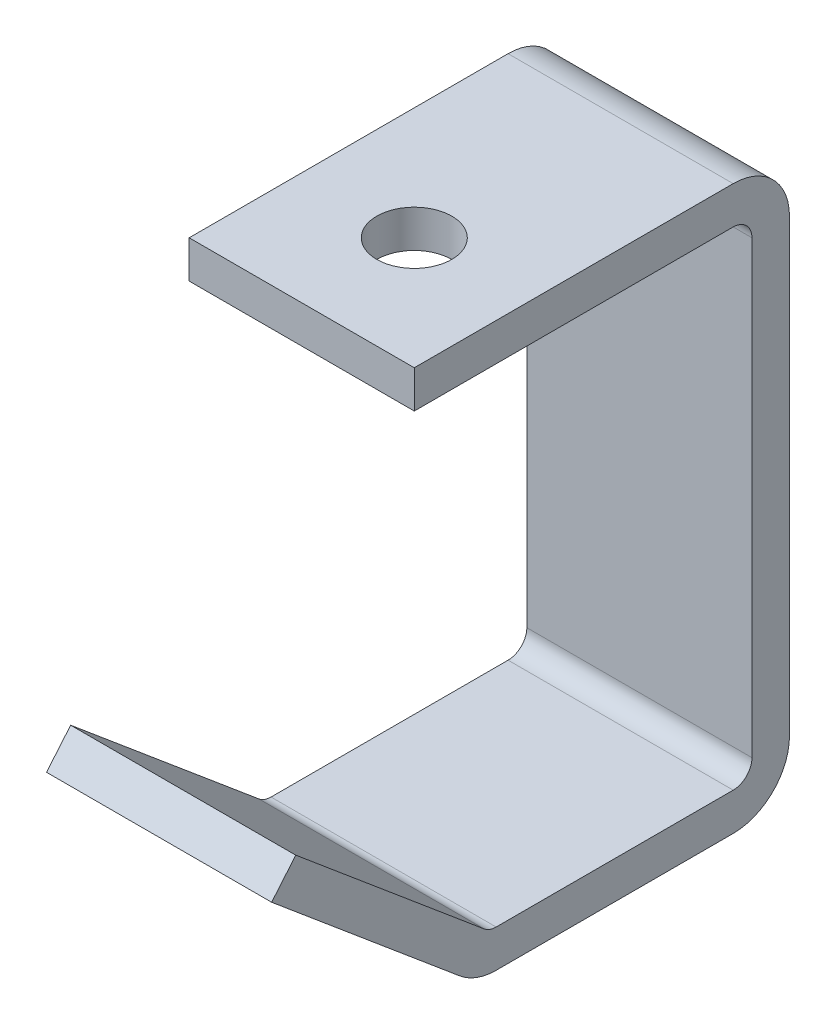
ISO-10303-21;
HEADER;
FILE_DESCRIPTION(('STEP AP214'),'2;1');
FILE_NAME('part.step','',(''),(''),'','','');
FILE_SCHEMA(('AUTOMOTIVE_DESIGN { 1 0 10303 214 1 1 1 1 }'));
ENDSEC;
DATA;
#1=APPLICATION_CONTEXT('core data for automotive mechanical design processes');
#2=APPLICATION_PROTOCOL_DEFINITION('international standard','automotive_design',2000,#1);
#3=PRODUCT_CONTEXT('',#1,'mechanical');
#4=PRODUCT('Part','Part','',(#3));
#5=PRODUCT_RELATED_PRODUCT_CATEGORY('part','',(#4));
#6=PRODUCT_DEFINITION_FORMATION('','',#4);
#7=PRODUCT_DEFINITION_CONTEXT('part definition',#1,'design');
#8=PRODUCT_DEFINITION('design','',#6,#7);
#9=PRODUCT_DEFINITION_SHAPE('','',#8);
#10=(LENGTH_UNIT() NAMED_UNIT(*) SI_UNIT(.MILLI.,.METRE.));
#11=(NAMED_UNIT(*) PLANE_ANGLE_UNIT() SI_UNIT($,.RADIAN.));
#12=(NAMED_UNIT(*) SI_UNIT($,.STERADIAN.) SOLID_ANGLE_UNIT());
#13=UNCERTAINTY_MEASURE_WITH_UNIT(LENGTH_MEASURE(1.E-05),#10,'distance_accuracy_value','');
#14=(GEOMETRIC_REPRESENTATION_CONTEXT(3) GLOBAL_UNCERTAINTY_ASSIGNED_CONTEXT((#13)) GLOBAL_UNIT_ASSIGNED_CONTEXT((#10,
#11,#12)) REPRESENTATION_CONTEXT('',''));
#15=CARTESIAN_POINT('',(0.,0.,0.));
#16=DIRECTION('',(0.,0.,1.));
#17=DIRECTION('',(1.,0.,0.));
#18=AXIS2_PLACEMENT_3D('',#15,#16,#17);
#19=CARTESIAN_POINT('',(19.05,82.55,57.15));
#20=DIRECTION('',(0.,0.,-1.));
#21=DIRECTION('',(0.,1.,0.));
#22=AXIS2_PLACEMENT_3D('',#19,#20,#21);
#23=PLANE('',#22);
#24=DIRECTION('',(-1.,0.,0.));
#25=VECTOR('',#24,1.);
#26=CARTESIAN_POINT('',(19.05,82.55,57.15));
#27=LINE('',#26,#25);
#28=CARTESIAN_POINT('',(19.05,82.55,57.15));
#29=VERTEX_POINT('',#28);
#30=CARTESIAN_POINT('',(-19.05,82.55,57.15));
#31=VERTEX_POINT('',#30);
#32=EDGE_CURVE('E165',#29,#31,#27,.T.);
#33=ORIENTED_EDGE('',*,*,#32,.F.);
#34=DIRECTION('',(0.,-1.,0.));
#35=VECTOR('',#34,1.);
#36=CARTESIAN_POINT('',(19.05,82.55,57.15));
#37=LINE('',#36,#35);
#38=CARTESIAN_POINT('',(19.05,88.9,57.15));
#39=VERTEX_POINT('',#38);
#40=EDGE_CURVE('E180',#39,#29,#37,.T.);
#41=ORIENTED_EDGE('',*,*,#40,.F.);
#42=DIRECTION('',(-1.,0.,0.));
#43=VECTOR('',#42,1.);
#44=CARTESIAN_POINT('',(19.05,88.9,57.15));
#45=LINE('',#44,#43);
#46=CARTESIAN_POINT('',(-19.05,88.9,57.15));
#47=VERTEX_POINT('',#46);
#48=EDGE_CURVE('E205',#39,#47,#45,.T.);
#49=ORIENTED_EDGE('',*,*,#48,.T.);
#50=DIRECTION('',(0.,-1.,0.));
#51=VECTOR('',#50,1.);
#52=CARTESIAN_POINT('',(-19.05,82.55,57.15));
#53=LINE('',#52,#51);
#54=EDGE_CURVE('E192',#47,#31,#53,.T.);
#55=ORIENTED_EDGE('',*,*,#54,.T.);
#56=EDGE_LOOP('',(#33,#41,#49,#55));
#57=FACE_BOUND('',#56,.T.);
#58=ADVANCED_FACE('F38',(#57),#23,.F.);
#59=CARTESIAN_POINT('',(19.05,27.488043347538,77.2089744128137));
#60=DIRECTION('',(0.,0.64278760968654,0.766044443118977));
#61=DIRECTION('',(0.,-0.766044443118977,0.64278760968654));
#62=AXIS2_PLACEMENT_3D('',#59,#60,#61);
#63=PLANE('',#62);
#64=DIRECTION('',(0.,0.766044443118977,-0.64278760968654));
#65=VECTOR('',#64,1.);
#66=CARTESIAN_POINT('',(19.05,27.488043347538,77.2089744128137));
#67=LINE('',#66,#65);
#68=CARTESIAN_POINT('',(19.05,22.6236611337325,81.2906757343232));
#69=VERTEX_POINT('',#68);
#70=CARTESIAN_POINT('',(19.05,27.488043347538,77.2089744128137));
#71=VERTEX_POINT('',#70);
#72=EDGE_CURVE('E171',#69,#71,#67,.T.);
#73=ORIENTED_EDGE('',*,*,#72,.T.);
#74=DIRECTION('',(-1.,0.,0.));
#75=VECTOR('',#74,1.);
#76=CARTESIAN_POINT('',(19.05,27.488043347538,77.2089744128137));
#77=LINE('',#76,#75);
#78=CARTESIAN_POINT('',(-19.05,27.488043347538,77.2089744128137));
#79=VERTEX_POINT('',#78);
#80=EDGE_CURVE('E153',#71,#79,#77,.T.);
#81=ORIENTED_EDGE('',*,*,#80,.T.);
#82=DIRECTION('',(0.,0.766044443118977,-0.64278760968654));
#83=VECTOR('',#82,1.);
#84=CARTESIAN_POINT('',(-19.05,27.488043347538,77.2089744128137));
#85=LINE('',#84,#83);
#86=CARTESIAN_POINT('',(-19.05,22.6236611337325,81.2906757343232));
#87=VERTEX_POINT('',#86);
#88=EDGE_CURVE('E190',#87,#79,#85,.T.);
#89=ORIENTED_EDGE('',*,*,#88,.F.);
#90=DIRECTION('',(-1.,0.,0.));
#91=VECTOR('',#90,1.);
#92=CARTESIAN_POINT('',(19.05,22.6236611337325,81.2906757343232));
#93=LINE('',#92,#91);
#94=EDGE_CURVE('E178',#69,#87,#93,.T.);
#95=ORIENTED_EDGE('',*,*,#94,.F.);
#96=EDGE_LOOP('',(#73,#81,#89,#95));
#97=FACE_BOUND('',#96,.T.);
#98=ADVANCED_FACE('F177',(#97),#63,.T.);
#99=CARTESIAN_POINT('',(19.05,0.,0.));
#100=DIRECTION('',(1.,0.,0.));
#101=DIRECTION('',(0.,0.,-1.));
#102=AXIS2_PLACEMENT_3D('',#99,#100,#101);
#103=PLANE('',#102);
#104=DIRECTION('',(0.,-0.64278760968654,-0.766044443118977));
#105=VECTOR('',#104,1.);
#106=CARTESIAN_POINT('',(19.05,22.6236611337325,81.2906757343232));
#107=LINE('',#106,#105);
#108=CARTESIAN_POINT('',(19.05,-4.12157332070826,49.4169464884691));
#109=VERTEX_POINT('',#108);
#110=EDGE_CURVE('E181',#69,#109,#107,.T.);
#111=ORIENTED_EDGE('',*,*,#110,.T.);
#112=CARTESIAN_POINT('',(19.05,3.175,43.2943945062048));
#113=DIRECTION('',(1.,0.,0.));
#114=DIRECTION('',(0.,0.,-1.));
#115=AXIS2_PLACEMENT_3D('',#112,#113,#114);
#116=CIRCLE('',#115,9.525);
#117=CARTESIAN_POINT('',(19.05,-6.35,43.2943945062048));
#118=VERTEX_POINT('',#117);
#119=EDGE_CURVE('E254',#109,#118,#116,.T.);
#120=ORIENTED_EDGE('',*,*,#119,.T.);
#121=DIRECTION('',(0.,0.,-1.));
#122=VECTOR('',#121,1.);
#123=CARTESIAN_POINT('',(19.05,-6.35,44.45));
#124=LINE('',#123,#122);
#125=CARTESIAN_POINT('',(19.05,-6.35,3.175));
#126=VERTEX_POINT('',#125);
#127=EDGE_CURVE('E186',#118,#126,#124,.T.);
#128=ORIENTED_EDGE('',*,*,#127,.T.);
#129=CARTESIAN_POINT('',(19.05,3.17500000000001,3.175));
#130=DIRECTION('',(1.,0.,0.));
#131=DIRECTION('',(0.,0.,-1.));
#132=AXIS2_PLACEMENT_3D('',#129,#130,#131);
#133=CIRCLE('',#132,9.525);
#134=CARTESIAN_POINT('',(19.05,3.17500000000001,-6.35));
#135=VERTEX_POINT('',#134);
#136=EDGE_CURVE('E59',#126,#135,#133,.T.);
#137=ORIENTED_EDGE('',*,*,#136,.T.);
#138=DIRECTION('',(0.,-1.,0.));
#139=VECTOR('',#138,1.);
#140=CARTESIAN_POINT('',(19.05,82.55,-6.35));
#141=LINE('',#140,#139);
#142=CARTESIAN_POINT('',(19.05,79.375,-6.35));
#143=VERTEX_POINT('',#142);
#144=EDGE_CURVE('E208',#143,#135,#141,.T.);
#145=ORIENTED_EDGE('',*,*,#144,.F.);
#146=CARTESIAN_POINT('',(19.05,79.375,3.175));
#147=DIRECTION('',(1.,0.,0.));
#148=DIRECTION('',(0.,0.,-1.));
#149=AXIS2_PLACEMENT_3D('',#146,#147,#148);
#150=CIRCLE('',#149,9.525);
#151=CARTESIAN_POINT('',(19.05,88.9,3.175));
#152=VERTEX_POINT('',#151);
#153=EDGE_CURVE('E53',#143,#152,#150,.T.);
#154=ORIENTED_EDGE('',*,*,#153,.T.);
#155=DIRECTION('',(0.,0.,-1.));
#156=VECTOR('',#155,1.);
#157=CARTESIAN_POINT('',(19.05,88.9,57.15));
#158=LINE('',#157,#156);
#159=EDGE_CURVE('E184',#39,#152,#158,.T.);
#160=ORIENTED_EDGE('',*,*,#159,.F.);
#161=ORIENTED_EDGE('',*,*,#40,.T.);
#162=DIRECTION('',(0.,0.,-1.));
#163=VECTOR('',#162,1.);
#164=CARTESIAN_POINT('',(19.05,82.55,57.15));
#165=LINE('',#164,#163);
#166=CARTESIAN_POINT('',(19.05,82.55,3.175));
#167=VERTEX_POINT('',#166);
#168=EDGE_CURVE('E166',#29,#167,#165,.T.);
#169=ORIENTED_EDGE('',*,*,#168,.T.);
#170=CARTESIAN_POINT('',(19.05,79.375,3.175));
#171=DIRECTION('',(1.,0.,0.));
#172=DIRECTION('',(0.,0.,-1.));
#173=AXIS2_PLACEMENT_3D('',#170,#171,#172);
#174=CIRCLE('',#173,3.175);
#175=CARTESIAN_POINT('',(19.05,79.375,0.));
#176=VERTEX_POINT('',#175);
#177=EDGE_CURVE('E237',#167,#176,#174,.F.);
#178=ORIENTED_EDGE('',*,*,#177,.T.);
#179=DIRECTION('',(0.,-1.,0.));
#180=VECTOR('',#179,1.);
#181=CARTESIAN_POINT('',(19.05,82.55,0.));
#182=LINE('',#181,#180);
#183=CARTESIAN_POINT('',(19.05,3.175,0.));
#184=VERTEX_POINT('',#183);
#185=EDGE_CURVE('E284',#176,#184,#182,.T.);
#186=ORIENTED_EDGE('',*,*,#185,.T.);
#187=CARTESIAN_POINT('',(19.05,3.175,3.175));
#188=DIRECTION('',(1.,0.,0.));
#189=DIRECTION('',(0.,0.,-1.));
#190=AXIS2_PLACEMENT_3D('',#187,#188,#189);
#191=CIRCLE('',#190,3.175);
#192=CARTESIAN_POINT('',(19.05,0.,3.175));
#193=VERTEX_POINT('',#192);
#194=EDGE_CURVE('E233',#184,#193,#191,.F.);
#195=ORIENTED_EDGE('',*,*,#194,.T.);
#196=DIRECTION('',(0.,0.,-1.));
#197=VECTOR('',#196,1.);
#198=CARTESIAN_POINT('',(19.05,0.,44.45));
#199=LINE('',#198,#197);
#200=CARTESIAN_POINT('',(19.05,0.,43.2943945062048));
#201=VERTEX_POINT('',#200);
#202=EDGE_CURVE('E175',#201,#193,#199,.T.);
#203=ORIENTED_EDGE('',*,*,#202,.F.);
#204=CARTESIAN_POINT('',(19.05,3.175,43.2943945062048));
#205=DIRECTION('',(1.,0.,0.));
#206=DIRECTION('',(0.,0.,-1.));
#207=AXIS2_PLACEMENT_3D('',#204,#205,#206);
#208=CIRCLE('',#207,3.175);
#209=CARTESIAN_POINT('',(19.05,0.74280889309725,45.3352451669596));
#210=VERTEX_POINT('',#209);
#211=EDGE_CURVE('E174',#201,#210,#208,.F.);
#212=ORIENTED_EDGE('',*,*,#211,.T.);
#213=DIRECTION('',(0.,-0.64278760968654,-0.766044443118977));
#214=VECTOR('',#213,1.);
#215=CARTESIAN_POINT('',(19.05,27.488043347538,77.2089744128137));
#216=LINE('',#215,#214);
#217=EDGE_CURVE('E157',#71,#210,#216,.T.);
#218=ORIENTED_EDGE('',*,*,#217,.F.);
#219=ORIENTED_EDGE('',*,*,#72,.F.);
#220=EDGE_LOOP('',(#111,#120,#128,#137,#145,#154,#160,#161,#169,#178,#186,#195,#203,#212,#218,#219));
#221=FACE_BOUND('',#220,.T.);
#222=ADVANCED_FACE('F170',(#221),#103,.T.);
#223=CARTESIAN_POINT('',(19.05,82.55,-6.35));
#224=DIRECTION('',(0.,0.,-1.));
#225=DIRECTION('',(0.,1.,0.));
#226=AXIS2_PLACEMENT_3D('',#223,#224,#225);
#227=PLANE('',#226);
#228=ORIENTED_EDGE('',*,*,#144,.T.);
#229=DIRECTION('',(-1.,0.,0.));
#230=VECTOR('',#229,1.);
#231=CARTESIAN_POINT('',(-19.05,3.17500000000001,-6.35));
#232=LINE('',#231,#230);
#233=CARTESIAN_POINT('',(-19.05,3.17500000000001,-6.35));
#234=VERTEX_POINT('',#233);
#235=EDGE_CURVE('E46',#135,#234,#232,.T.);
#236=ORIENTED_EDGE('',*,*,#235,.T.);
#237=DIRECTION('',(0.,-1.,0.));
#238=VECTOR('',#237,1.);
#239=CARTESIAN_POINT('',(-19.05,82.55,-6.35));
#240=LINE('',#239,#238);
#241=CARTESIAN_POINT('',(-19.05,79.375,-6.35));
#242=VERTEX_POINT('',#241);
#243=EDGE_CURVE('E197',#242,#234,#240,.T.);
#244=ORIENTED_EDGE('',*,*,#243,.F.);
#245=DIRECTION('',(-1.,0.,0.));
#246=VECTOR('',#245,1.);
#247=CARTESIAN_POINT('',(19.05,79.375,-6.35));
#248=LINE('',#247,#246);
#249=EDGE_CURVE('E256',#242,#143,#248,.F.);
#250=ORIENTED_EDGE('',*,*,#249,.T.);
#251=EDGE_LOOP('',(#228,#236,#244,#250));
#252=FACE_BOUND('',#251,.T.);
#253=ADVANCED_FACE('F261',(#252),#227,.T.);
#254=CARTESIAN_POINT('',(19.05,88.9,57.15));
#255=DIRECTION('',(0.,1.,0.));
#256=DIRECTION('',(0.,0.,1.));
#257=AXIS2_PLACEMENT_3D('',#254,#255,#256);
#258=PLANE('',#257);
#259=CARTESIAN_POINT('',(0.,88.9,38.1));
#260=DIRECTION('',(0.,1.,0.));
#261=DIRECTION('',(0.,0.,1.));
#262=AXIS2_PLACEMENT_3D('',#259,#260,#261);
#263=CIRCLE('',#262,6.35);
#264=CARTESIAN_POINT('',(0.,88.9,44.45));
#265=VERTEX_POINT('',#264);
#266=EDGE_CURVE('E300',#265,#265,#263,.T.);
#267=ORIENTED_EDGE('',*,*,#266,.F.);
#268=EDGE_LOOP('',(#267));
#269=FACE_BOUND('',#268,.T.);
#270=ORIENTED_EDGE('',*,*,#159,.T.);
#271=DIRECTION('',(-1.,0.,0.));
#272=VECTOR('',#271,1.);
#273=CARTESIAN_POINT('',(19.05,88.9,3.175));
#274=LINE('',#273,#272);
#275=CARTESIAN_POINT('',(-19.05,88.9,3.175));
#276=VERTEX_POINT('',#275);
#277=EDGE_CURVE('E11',#152,#276,#274,.T.);
#278=ORIENTED_EDGE('',*,*,#277,.T.);
#279=DIRECTION('',(0.,0.,-1.));
#280=VECTOR('',#279,1.);
#281=CARTESIAN_POINT('',(-19.05,88.9,57.15));
#282=LINE('',#281,#280);
#283=EDGE_CURVE('E196',#47,#276,#282,.T.);
#284=ORIENTED_EDGE('',*,*,#283,.F.);
#285=ORIENTED_EDGE('',*,*,#48,.F.);
#286=EDGE_LOOP('',(#270,#278,#284,#285));
#287=FACE_BOUND('',#286,.T.);
#288=ADVANCED_FACE('F272',(#269,#287),#258,.T.);
#289=CARTESIAN_POINT('',(19.05,22.6236611337325,81.2906757343232));
#290=DIRECTION('',(0.,0.766044443118977,-0.642787609686541));
#291=DIRECTION('',(0.,0.64278760968654,0.766044443118977));
#292=AXIS2_PLACEMENT_3D('',#289,#290,#291);
#293=PLANE('',#292);
#294=DIRECTION('',(0.,-0.64278760968654,-0.766044443118977));
#295=VECTOR('',#294,1.);
#296=CARTESIAN_POINT('',(-19.05,22.6236611337325,81.2906757343232));
#297=LINE('',#296,#295);
#298=CARTESIAN_POINT('',(-19.05,-4.12157332070826,49.4169464884691));
#299=VERTEX_POINT('',#298);
#300=EDGE_CURVE('E193',#87,#299,#297,.T.);
#301=ORIENTED_EDGE('',*,*,#300,.T.);
#302=DIRECTION('',(-1.,0.,0.));
#303=VECTOR('',#302,1.);
#304=CARTESIAN_POINT('',(19.05,-4.12157332070826,49.4169464884691));
#305=LINE('',#304,#303);
#306=EDGE_CURVE('E250',#299,#109,#305,.F.);
#307=ORIENTED_EDGE('',*,*,#306,.T.);
#308=ORIENTED_EDGE('',*,*,#110,.F.);
#309=ORIENTED_EDGE('',*,*,#94,.T.);
#310=EDGE_LOOP('',(#301,#307,#308,#309));
#311=FACE_BOUND('',#310,.T.);
#312=ADVANCED_FACE('F333',(#311),#293,.F.);
#313=CARTESIAN_POINT('',(19.05,-6.35,44.45));
#314=DIRECTION('',(0.,1.,0.));
#315=DIRECTION('',(0.,0.,1.));
#316=AXIS2_PLACEMENT_3D('',#313,#314,#315);
#317=PLANE('',#316);
#318=ORIENTED_EDGE('',*,*,#127,.F.);
#319=DIRECTION('',(-1.,0.,0.));
#320=VECTOR('',#319,1.);
#321=CARTESIAN_POINT('',(19.05,-6.35,43.2943945062048));
#322=LINE('',#321,#320);
#323=CARTESIAN_POINT('',(-19.05,-6.35,43.2943945062048));
#324=VERTEX_POINT('',#323);
#325=EDGE_CURVE('E241',#118,#324,#322,.T.);
#326=ORIENTED_EDGE('',*,*,#325,.T.);
#327=DIRECTION('',(0.,0.,-1.));
#328=VECTOR('',#327,1.);
#329=CARTESIAN_POINT('',(-19.05,-6.35,44.45));
#330=LINE('',#329,#328);
#331=CARTESIAN_POINT('',(-19.05,-6.35,3.175));
#332=VERTEX_POINT('',#331);
#333=EDGE_CURVE('E200',#324,#332,#330,.T.);
#334=ORIENTED_EDGE('',*,*,#333,.T.);
#335=DIRECTION('',(-1.,0.,0.));
#336=VECTOR('',#335,1.);
#337=CARTESIAN_POINT('',(19.05,-6.35,3.175));
#338=LINE('',#337,#336);
#339=EDGE_CURVE('E239',#332,#126,#338,.F.);
#340=ORIENTED_EDGE('',*,*,#339,.T.);
#341=EDGE_LOOP('',(#318,#326,#334,#340));
#342=FACE_BOUND('',#341,.T.);
#343=ADVANCED_FACE('F340',(#342),#317,.F.);
#344=CARTESIAN_POINT('',(-19.05,0.,0.));
#345=DIRECTION('',(1.,0.,0.));
#346=DIRECTION('',(0.,0.,-1.));
#347=AXIS2_PLACEMENT_3D('',#344,#345,#346);
#348=PLANE('',#347);
#349=ORIENTED_EDGE('',*,*,#333,.F.);
#350=CARTESIAN_POINT('',(-19.05,3.175,43.2943945062048));
#351=DIRECTION('',(1.,0.,0.));
#352=DIRECTION('',(0.,0.,-1.));
#353=AXIS2_PLACEMENT_3D('',#350,#351,#352);
#354=CIRCLE('',#353,9.525);
#355=EDGE_CURVE('E248',#324,#299,#354,.F.);
#356=ORIENTED_EDGE('',*,*,#355,.T.);
#357=ORIENTED_EDGE('',*,*,#300,.F.);
#358=ORIENTED_EDGE('',*,*,#88,.T.);
#359=DIRECTION('',(0.,-0.64278760968654,-0.766044443118977));
#360=VECTOR('',#359,1.);
#361=CARTESIAN_POINT('',(-19.05,27.488043347538,77.2089744128137));
#362=LINE('',#361,#360);
#363=CARTESIAN_POINT('',(-19.05,0.74280889309725,45.3352451669596));
#364=VERTEX_POINT('',#363);
#365=EDGE_CURVE('E160',#79,#364,#362,.T.);
#366=ORIENTED_EDGE('',*,*,#365,.T.);
#367=CARTESIAN_POINT('',(-19.05,3.175,43.2943945062048));
#368=DIRECTION('',(1.,0.,0.));
#369=DIRECTION('',(0.,0.,-1.));
#370=AXIS2_PLACEMENT_3D('',#367,#368,#369);
#371=CIRCLE('',#370,3.175);
#372=CARTESIAN_POINT('',(-19.05,0.,43.2943945062048));
#373=VERTEX_POINT('',#372);
#374=EDGE_CURVE('E228',#364,#373,#371,.T.);
#375=ORIENTED_EDGE('',*,*,#374,.T.);
#376=DIRECTION('',(0.,0.,-1.));
#377=VECTOR('',#376,1.);
#378=CARTESIAN_POINT('',(-19.05,0.,44.45));
#379=LINE('',#378,#377);
#380=CARTESIAN_POINT('',(-19.05,0.,3.175));
#381=VERTEX_POINT('',#380);
#382=EDGE_CURVE('E286',#373,#381,#379,.T.);
#383=ORIENTED_EDGE('',*,*,#382,.T.);
#384=CARTESIAN_POINT('',(-19.05,3.175,3.175));
#385=DIRECTION('',(1.,0.,0.));
#386=DIRECTION('',(0.,0.,-1.));
#387=AXIS2_PLACEMENT_3D('',#384,#385,#386);
#388=CIRCLE('',#387,3.175);
#389=CARTESIAN_POINT('',(-19.05,3.175,0.));
#390=VERTEX_POINT('',#389);
#391=EDGE_CURVE('E231',#381,#390,#388,.T.);
#392=ORIENTED_EDGE('',*,*,#391,.T.);
#393=DIRECTION('',(0.,-1.,0.));
#394=VECTOR('',#393,1.);
#395=CARTESIAN_POINT('',(-19.05,82.55,0.));
#396=LINE('',#395,#394);
#397=CARTESIAN_POINT('',(-19.05,79.375,0.));
#398=VERTEX_POINT('',#397);
#399=EDGE_CURVE('E290',#398,#390,#396,.T.);
#400=ORIENTED_EDGE('',*,*,#399,.F.);
#401=CARTESIAN_POINT('',(-19.05,79.375,3.175));
#402=DIRECTION('',(1.,0.,0.));
#403=DIRECTION('',(0.,0.,-1.));
#404=AXIS2_PLACEMENT_3D('',#401,#402,#403);
#405=CIRCLE('',#404,3.175);
#406=CARTESIAN_POINT('',(-19.05,82.55,3.175));
#407=VERTEX_POINT('',#406);
#408=EDGE_CURVE('E235',#398,#407,#405,.T.);
#409=ORIENTED_EDGE('',*,*,#408,.T.);
#410=DIRECTION('',(0.,0.,-1.));
#411=VECTOR('',#410,1.);
#412=CARTESIAN_POINT('',(-19.05,82.55,57.15));
#413=LINE('',#412,#411);
#414=EDGE_CURVE('E282',#31,#407,#413,.T.);
#415=ORIENTED_EDGE('',*,*,#414,.F.);
#416=ORIENTED_EDGE('',*,*,#54,.F.);
#417=ORIENTED_EDGE('',*,*,#283,.T.);
#418=CARTESIAN_POINT('',(-19.05,79.375,3.175));
#419=DIRECTION('',(1.,0.,0.));
#420=DIRECTION('',(0.,0.,-1.));
#421=AXIS2_PLACEMENT_3D('',#418,#419,#420);
#422=CIRCLE('',#421,9.525);
#423=EDGE_CURVE('E244',#276,#242,#422,.F.);
#424=ORIENTED_EDGE('',*,*,#423,.T.);
#425=ORIENTED_EDGE('',*,*,#243,.T.);
#426=CARTESIAN_POINT('',(-19.05,3.17500000000001,3.175));
#427=DIRECTION('',(1.,0.,0.));
#428=DIRECTION('',(0.,0.,-1.));
#429=AXIS2_PLACEMENT_3D('',#426,#427,#428);
#430=CIRCLE('',#429,9.525);
#431=EDGE_CURVE('E246',#234,#332,#430,.F.);
#432=ORIENTED_EDGE('',*,*,#431,.T.);
#433=EDGE_LOOP('',(#349,#356,#357,#358,#366,#375,#383,#392,#400,#409,#415,#416,#417,#424,#425,#432));
#434=FACE_BOUND('',#433,.T.);
#435=ADVANCED_FACE('F266',(#434),#348,.F.);
#436=CARTESIAN_POINT('',(19.05,82.55,0.));
#437=DIRECTION('',(0.,0.,-1.));
#438=DIRECTION('',(0.,1.,0.));
#439=AXIS2_PLACEMENT_3D('',#436,#437,#438);
#440=PLANE('',#439);
#441=ORIENTED_EDGE('',*,*,#399,.T.);
#442=DIRECTION('',(-1.,0.,0.));
#443=VECTOR('',#442,1.);
#444=CARTESIAN_POINT('',(19.05,3.175,0.));
#445=LINE('',#444,#443);
#446=EDGE_CURVE('E224',#390,#184,#445,.F.);
#447=ORIENTED_EDGE('',*,*,#446,.T.);
#448=ORIENTED_EDGE('',*,*,#185,.F.);
#449=DIRECTION('',(-1.,0.,0.));
#450=VECTOR('',#449,1.);
#451=CARTESIAN_POINT('',(-19.05,79.375,0.));
#452=LINE('',#451,#450);
#453=EDGE_CURVE('E221',#176,#398,#452,.T.);
#454=ORIENTED_EDGE('',*,*,#453,.T.);
#455=EDGE_LOOP('',(#441,#447,#448,#454));
#456=FACE_BOUND('',#455,.T.);
#457=ADVANCED_FACE('F310',(#456),#440,.F.);
#458=CARTESIAN_POINT('',(19.05,82.55,57.15));
#459=DIRECTION('',(0.,1.,0.));
#460=DIRECTION('',(0.,0.,1.));
#461=AXIS2_PLACEMENT_3D('',#458,#459,#460);
#462=PLANE('',#461);
#463=CARTESIAN_POINT('',(0.,82.55,38.1));
#464=DIRECTION('',(0.,1.,0.));
#465=DIRECTION('',(0.,0.,1.));
#466=AXIS2_PLACEMENT_3D('',#463,#464,#465);
#467=CIRCLE('',#466,6.35);
#468=CARTESIAN_POINT('',(0.,82.55,44.45));
#469=VERTEX_POINT('',#468);
#470=EDGE_CURVE('E293',#469,#469,#467,.F.);
#471=ORIENTED_EDGE('',*,*,#470,.F.);
#472=EDGE_LOOP('',(#471));
#473=FACE_BOUND('',#472,.T.);
#474=ORIENTED_EDGE('',*,*,#414,.T.);
#475=DIRECTION('',(-1.,0.,0.));
#476=VECTOR('',#475,1.);
#477=CARTESIAN_POINT('',(19.05,82.55,3.175));
#478=LINE('',#477,#476);
#479=EDGE_CURVE('E226',#407,#167,#478,.F.);
#480=ORIENTED_EDGE('',*,*,#479,.T.);
#481=ORIENTED_EDGE('',*,*,#168,.F.);
#482=ORIENTED_EDGE('',*,*,#32,.T.);
#483=EDGE_LOOP('',(#474,#480,#481,#482));
#484=FACE_BOUND('',#483,.T.);
#485=ADVANCED_FACE('F308',(#473,#484),#462,.F.);
#486=CARTESIAN_POINT('',(19.05,27.488043347538,77.2089744128137));
#487=DIRECTION('',(0.,0.766044443118977,-0.642787609686541));
#488=DIRECTION('',(0.,0.64278760968654,0.766044443118977));
#489=AXIS2_PLACEMENT_3D('',#486,#487,#488);
#490=PLANE('',#489);
#491=ORIENTED_EDGE('',*,*,#217,.T.);
#492=DIRECTION('',(-1.,0.,0.));
#493=VECTOR('',#492,1.);
#494=CARTESIAN_POINT('',(-19.05,0.742808893097247,45.3352451669596));
#495=LINE('',#494,#493);
#496=EDGE_CURVE('E212',#210,#364,#495,.T.);
#497=ORIENTED_EDGE('',*,*,#496,.T.);
#498=ORIENTED_EDGE('',*,*,#365,.F.);
#499=ORIENTED_EDGE('',*,*,#80,.F.);
#500=EDGE_LOOP('',(#491,#497,#498,#499));
#501=FACE_BOUND('',#500,.T.);
#502=ADVANCED_FACE('F155',(#501),#490,.T.);
#503=CARTESIAN_POINT('',(19.05,0.,44.45));
#504=DIRECTION('',(0.,1.,0.));
#505=DIRECTION('',(0.,0.,1.));
#506=AXIS2_PLACEMENT_3D('',#503,#504,#505);
#507=PLANE('',#506);
#508=ORIENTED_EDGE('',*,*,#382,.F.);
#509=DIRECTION('',(-1.,0.,0.));
#510=VECTOR('',#509,1.);
#511=CARTESIAN_POINT('',(19.05,0.,43.2943945062048));
#512=LINE('',#511,#510);
#513=EDGE_CURVE('E219',#373,#201,#512,.F.);
#514=ORIENTED_EDGE('',*,*,#513,.T.);
#515=ORIENTED_EDGE('',*,*,#202,.T.);
#516=DIRECTION('',(-1.,0.,0.));
#517=VECTOR('',#516,1.);
#518=CARTESIAN_POINT('',(19.05,0.,3.175));
#519=LINE('',#518,#517);
#520=EDGE_CURVE('E216',#193,#381,#519,.T.);
#521=ORIENTED_EDGE('',*,*,#520,.T.);
#522=EDGE_LOOP('',(#508,#514,#515,#521));
#523=FACE_BOUND('',#522,.T.);
#524=ADVANCED_FACE('F326',(#523),#507,.T.);
#525=CARTESIAN_POINT('',(19.05,3.175,43.2943945062048));
#526=DIRECTION('',(1.,0.,0.));
#527=DIRECTION('',(0.,0.,-1.));
#528=AXIS2_PLACEMENT_3D('',#525,#526,#527);
#529=CYLINDRICAL_SURFACE('',#528,3.175);
#530=ORIENTED_EDGE('',*,*,#211,.F.);
#531=ORIENTED_EDGE('',*,*,#513,.F.);
#532=ORIENTED_EDGE('',*,*,#374,.F.);
#533=ORIENTED_EDGE('',*,*,#496,.F.);
#534=EDGE_LOOP('',(#530,#531,#532,#533));
#535=FACE_BOUND('',#534,.T.);
#536=ADVANCED_FACE('F329',(#535),#529,.F.);
#537=CARTESIAN_POINT('',(19.05,3.175,3.175));
#538=DIRECTION('',(-1.,0.,0.));
#539=DIRECTION('',(0.,0.,1.));
#540=AXIS2_PLACEMENT_3D('',#537,#538,#539);
#541=CYLINDRICAL_SURFACE('',#540,3.175);
#542=ORIENTED_EDGE('',*,*,#194,.F.);
#543=ORIENTED_EDGE('',*,*,#446,.F.);
#544=ORIENTED_EDGE('',*,*,#391,.F.);
#545=ORIENTED_EDGE('',*,*,#520,.F.);
#546=EDGE_LOOP('',(#542,#543,#544,#545));
#547=FACE_BOUND('',#546,.T.);
#548=ADVANCED_FACE('F322',(#547),#541,.F.);
#549=CARTESIAN_POINT('',(19.05,79.375,3.175));
#550=DIRECTION('',(1.,0.,0.));
#551=DIRECTION('',(0.,0.,-1.));
#552=AXIS2_PLACEMENT_3D('',#549,#550,#551);
#553=CYLINDRICAL_SURFACE('',#552,3.175);
#554=ORIENTED_EDGE('',*,*,#177,.F.);
#555=ORIENTED_EDGE('',*,*,#479,.F.);
#556=ORIENTED_EDGE('',*,*,#408,.F.);
#557=ORIENTED_EDGE('',*,*,#453,.F.);
#558=EDGE_LOOP('',(#554,#555,#556,#557));
#559=FACE_BOUND('',#558,.T.);
#560=ADVANCED_FACE('F314',(#559),#553,.F.);
#561=CARTESIAN_POINT('',(19.05,3.175,43.2943945062048));
#562=DIRECTION('',(-1.,0.,0.));
#563=DIRECTION('',(0.,0.,1.));
#564=AXIS2_PLACEMENT_3D('',#561,#562,#563);
#565=CYLINDRICAL_SURFACE('',#564,9.525);
#566=ORIENTED_EDGE('',*,*,#119,.F.);
#567=ORIENTED_EDGE('',*,*,#306,.F.);
#568=ORIENTED_EDGE('',*,*,#355,.F.);
#569=ORIENTED_EDGE('',*,*,#325,.F.);
#570=EDGE_LOOP('',(#566,#567,#568,#569));
#571=FACE_BOUND('',#570,.T.);
#572=ADVANCED_FACE('F336',(#571),#565,.T.);
#573=CARTESIAN_POINT('',(19.05,3.17500000000001,3.175));
#574=DIRECTION('',(1.,0.,0.));
#575=DIRECTION('',(0.,0.,-1.));
#576=AXIS2_PLACEMENT_3D('',#573,#574,#575);
#577=CYLINDRICAL_SURFACE('',#576,9.525);
#578=ORIENTED_EDGE('',*,*,#136,.F.);
#579=ORIENTED_EDGE('',*,*,#339,.F.);
#580=ORIENTED_EDGE('',*,*,#431,.F.);
#581=ORIENTED_EDGE('',*,*,#235,.F.);
#582=EDGE_LOOP('',(#578,#579,#580,#581));
#583=FACE_BOUND('',#582,.T.);
#584=ADVANCED_FACE('F342',(#583),#577,.T.);
#585=CARTESIAN_POINT('',(19.05,79.375,3.175));
#586=DIRECTION('',(-1.,0.,0.));
#587=DIRECTION('',(0.,0.,1.));
#588=AXIS2_PLACEMENT_3D('',#585,#586,#587);
#589=CYLINDRICAL_SURFACE('',#588,9.525);
#590=ORIENTED_EDGE('',*,*,#153,.F.);
#591=ORIENTED_EDGE('',*,*,#249,.F.);
#592=ORIENTED_EDGE('',*,*,#423,.F.);
#593=ORIENTED_EDGE('',*,*,#277,.F.);
#594=EDGE_LOOP('',(#590,#591,#592,#593));
#595=FACE_BOUND('',#594,.T.);
#596=ADVANCED_FACE('F40',(#595),#589,.T.);
#597=CARTESIAN_POINT('',(0.,-6.351,38.1));
#598=DIRECTION('',(0.,1.,0.));
#599=DIRECTION('',(0.,0.,1.));
#600=AXIS2_PLACEMENT_3D('',#597,#598,#599);
#601=CYLINDRICAL_SURFACE('',#600,6.35);
#602=ORIENTED_EDGE('',*,*,#266,.T.);
#603=EDGE_LOOP('',(#602));
#604=FACE_BOUND('',#603,.T.);
#605=ORIENTED_EDGE('',*,*,#470,.T.);
#606=EDGE_LOOP('',(#605));
#607=FACE_BOUND('',#606,.T.);
#608=ADVANCED_FACE('F306',(#604,#607),#601,.F.);
#609=CLOSED_SHELL('',(#58,#98,#222,#253,#288,#312,#343,#435,#457,#485,#502,#524,#536,#548,#560,
#572,#584,#596,#608));
#610=MANIFOLD_SOLID_BREP('B2',#609);
#611=ADVANCED_BREP_SHAPE_REPRESENTATION('',(#18,#610),#14);
#612=SHAPE_DEFINITION_REPRESENTATION(#9,#611);
ENDSEC;
END-ISO-10303-21;
